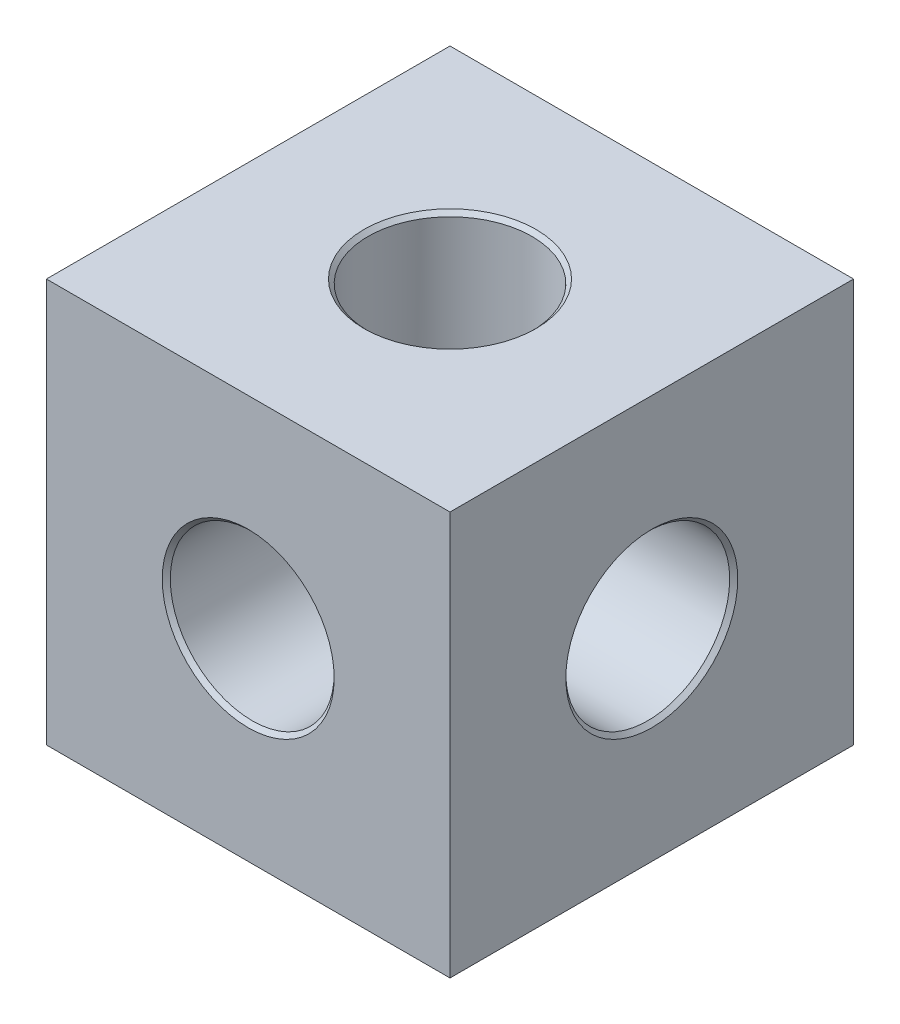
ISO-10303-21;
HEADER;
FILE_DESCRIPTION(('STEP AP214'),'2;1');
FILE_NAME('part.step','',(''),(''),'','','');
FILE_SCHEMA(('AUTOMOTIVE_DESIGN { 1 0 10303 214 1 1 1 1 }'));
ENDSEC;
DATA;
#1=APPLICATION_CONTEXT('core data for automotive mechanical design processes');
#2=APPLICATION_PROTOCOL_DEFINITION('international standard','automotive_design',2000,#1);
#3=PRODUCT_CONTEXT('',#1,'mechanical');
#4=PRODUCT('Part','Part','',(#3));
#5=PRODUCT_RELATED_PRODUCT_CATEGORY('part','',(#4));
#6=PRODUCT_DEFINITION_FORMATION('','',#4);
#7=PRODUCT_DEFINITION_CONTEXT('part definition',#1,'design');
#8=PRODUCT_DEFINITION('design','',#6,#7);
#9=PRODUCT_DEFINITION_SHAPE('','',#8);
#10=(LENGTH_UNIT() NAMED_UNIT(*) SI_UNIT(.MILLI.,.METRE.));
#11=(NAMED_UNIT(*) PLANE_ANGLE_UNIT() SI_UNIT($,.RADIAN.));
#12=(NAMED_UNIT(*) SI_UNIT($,.STERADIAN.) SOLID_ANGLE_UNIT());
#13=UNCERTAINTY_MEASURE_WITH_UNIT(LENGTH_MEASURE(1.E-05),#10,'distance_accuracy_value','');
#14=(GEOMETRIC_REPRESENTATION_CONTEXT(3) GLOBAL_UNCERTAINTY_ASSIGNED_CONTEXT((#13)) GLOBAL_UNIT_ASSIGNED_CONTEXT((#10,
#11,#12)) REPRESENTATION_CONTEXT('',''));
#15=CARTESIAN_POINT('',(0.,0.,0.));
#16=DIRECTION('',(0.,0.,1.));
#17=DIRECTION('',(1.,0.,0.));
#18=AXIS2_PLACEMENT_3D('',#15,#16,#17);
#19=CARTESIAN_POINT('',(-50.2304757814045,37.5309293141299,13.7079780012688));
#20=DIRECTION('',(0.,0.,1.));
#21=DIRECTION('',(1.,0.,0.));
#22=AXIS2_PLACEMENT_3D('',#19,#20,#21);
#23=CYLINDRICAL_SURFACE('',#22,5.1562);
#24=CARTESIAN_POINT('',(-50.2304757814045,37.5309293141299,13.4539780012688));
#25=DIRECTION('',(0.,0.,-1.));
#26=DIRECTION('',(-1.,0.,0.));
#27=AXIS2_PLACEMENT_3D('',#24,#25,#26);
#28=CIRCLE('',#27,5.1562);
#29=CARTESIAN_POINT('',(-55.3866757814045,37.5309293141299,13.4539780012688));
#30=VERTEX_POINT('',#29);
#31=EDGE_CURVE('E24',#30,#30,#28,.F.);
#32=ORIENTED_EDGE('',*,*,#31,.T.);
#33=EDGE_LOOP('',(#32));
#34=FACE_BOUND('',#33,.T.);
#35=CARTESIAN_POINT('',(-50.2304757814045,37.5309293141299,1.00797800126884));
#36=DIRECTION('',(0.,0.707106781186547,0.707106781186547));
#37=DIRECTION('',(0.,-0.707106781186547,0.707106781186547));
#38=AXIS2_PLACEMENT_3D('',#35,#36,#37);
#39=ELLIPSE('',#38,7.29196797030815,5.1562);
#40=CARTESIAN_POINT('',(-46.5844917962504,33.8849453289759,4.65396198642291));
#41=VERTEX_POINT('',#40);
#42=CARTESIAN_POINT('',(-53.8764597665586,33.8849453289759,4.65396198642291));
#43=VERTEX_POINT('',#42);
#44=EDGE_CURVE('E88',#41,#43,#39,.F.);
#45=ORIENTED_EDGE('',*,*,#44,.T.);
#46=CARTESIAN_POINT('',(-50.2304757814045,37.5309293141299,1.00797800126884));
#47=DIRECTION('',(0.707106781186548,0.,0.707106781186547));
#48=DIRECTION('',(-0.707106781186547,0.,0.707106781186547));
#49=AXIS2_PLACEMENT_3D('',#46,#47,#48);
#50=ELLIPSE('',#49,7.29196797030815,5.1562);
#51=CARTESIAN_POINT('',(-53.8764597665586,41.176913299284,4.65396198642291));
#52=VERTEX_POINT('',#51);
#53=EDGE_CURVE('E31',#43,#52,#50,.F.);
#54=ORIENTED_EDGE('',*,*,#53,.T.);
#55=CARTESIAN_POINT('',(-50.2304757814045,37.5309293141299,1.00797800126884));
#56=DIRECTION('',(0.,-0.707106781186547,0.707106781186547));
#57=DIRECTION('',(0.,0.707106781186547,0.707106781186547));
#58=AXIS2_PLACEMENT_3D('',#55,#56,#57);
#59=ELLIPSE('',#58,7.29196797030815,5.1562);
#60=CARTESIAN_POINT('',(-46.5844917962504,41.176913299284,4.65396198642291));
#61=VERTEX_POINT('',#60);
#62=EDGE_CURVE('E102',#52,#61,#59,.F.);
#63=ORIENTED_EDGE('',*,*,#62,.T.);
#64=CARTESIAN_POINT('',(-50.2304757814045,37.5309293141299,1.00797800126884));
#65=DIRECTION('',(-0.707106781186547,0.,0.707106781186547));
#66=DIRECTION('',(0.707106781186548,0.,0.707106781186547));
#67=AXIS2_PLACEMENT_3D('',#64,#65,#66);
#68=ELLIPSE('',#67,7.29196797030815,5.1562);
#69=EDGE_CURVE('E315',#61,#41,#68,.F.);
#70=ORIENTED_EDGE('',*,*,#69,.T.);
#71=EDGE_LOOP('',(#45,#54,#63,#70));
#72=FACE_BOUND('',#71,.T.);
#73=ADVANCED_FACE('F16',(#34,#72),#23,.F.);
#74=CARTESIAN_POINT('',(-62.9304757814045,50.2309293141299,-11.6920219987312));
#75=DIRECTION('',(1.,0.,0.));
#76=DIRECTION('',(0.,0.,-1.));
#77=AXIS2_PLACEMENT_3D('',#74,#75,#76);
#78=PLANE('',#77);
#79=CARTESIAN_POINT('',(-62.9304757814045,37.5309293141299,1.00797800126884));
#80=DIRECTION('',(1.,0.,0.));
#81=DIRECTION('',(0.,0.,-1.));
#82=AXIS2_PLACEMENT_3D('',#79,#80,#81);
#83=CIRCLE('',#82,3.6195);
#84=CARTESIAN_POINT('',(-62.9304757814045,37.5309293141299,-2.61152199873116));
#85=VERTEX_POINT('',#84);
#86=EDGE_CURVE('E118',#85,#85,#83,.T.);
#87=ORIENTED_EDGE('',*,*,#86,.T.);
#88=EDGE_LOOP('',(#87));
#89=FACE_BOUND('',#88,.T.);
#90=DIRECTION('',(0.,0.,1.));
#91=VECTOR('',#90,1.);
#92=CARTESIAN_POINT('',(-62.9304757814045,24.8309293141299,-11.6920219987312));
#93=LINE('',#92,#91);
#94=CARTESIAN_POINT('',(-62.9304757814045,24.8309293141299,-11.6920219987312));
#95=VERTEX_POINT('',#94);
#96=CARTESIAN_POINT('',(-62.9304757814045,24.8309293141299,13.7079780012688));
#97=VERTEX_POINT('',#96);
#98=EDGE_CURVE('E269',#95,#97,#93,.T.);
#99=ORIENTED_EDGE('',*,*,#98,.T.);
#100=DIRECTION('',(0.,-1.,0.));
#101=VECTOR('',#100,1.);
#102=CARTESIAN_POINT('',(-62.9304757814045,50.2309293141299,13.7079780012688));
#103=LINE('',#102,#101);
#104=CARTESIAN_POINT('',(-62.9304757814045,50.2309293141299,13.7079780012688));
#105=VERTEX_POINT('',#104);
#106=EDGE_CURVE('E106',#105,#97,#103,.T.);
#107=ORIENTED_EDGE('',*,*,#106,.F.);
#108=DIRECTION('',(0.,0.,1.));
#109=VECTOR('',#108,1.);
#110=CARTESIAN_POINT('',(-62.9304757814045,50.2309293141299,-11.6920219987312));
#111=LINE('',#110,#109);
#112=CARTESIAN_POINT('',(-62.9304757814045,50.2309293141299,-11.6920219987312));
#113=VERTEX_POINT('',#112);
#114=EDGE_CURVE('E270',#113,#105,#111,.T.);
#115=ORIENTED_EDGE('',*,*,#114,.F.);
#116=DIRECTION('',(0.,-1.,0.));
#117=VECTOR('',#116,1.);
#118=CARTESIAN_POINT('',(-62.9304757814045,50.2309293141299,-11.6920219987312));
#119=LINE('',#118,#117);
#120=EDGE_CURVE('E280',#113,#95,#119,.T.);
#121=ORIENTED_EDGE('',*,*,#120,.T.);
#122=EDGE_LOOP('',(#99,#107,#115,#121));
#123=FACE_BOUND('',#122,.T.);
#124=ADVANCED_FACE('F157',(#89,#123),#78,.F.);
#125=CARTESIAN_POINT('',(-62.9304757814045,50.2309293141299,13.7079780012688));
#126=DIRECTION('',(0.,0.,-1.));
#127=DIRECTION('',(-1.,0.,0.));
#128=AXIS2_PLACEMENT_3D('',#125,#126,#127);
#129=PLANE('',#128);
#130=CARTESIAN_POINT('',(-50.2304757814045,37.5309293141299,13.7079780012688));
#131=DIRECTION('',(0.,0.,-1.));
#132=DIRECTION('',(-1.,0.,0.));
#133=AXIS2_PLACEMENT_3D('',#130,#131,#132);
#134=CIRCLE('',#133,5.41020000000001);
#135=CARTESIAN_POINT('',(-55.6406757814045,37.5309293141299,13.7079780012688));
#136=VERTEX_POINT('',#135);
#137=EDGE_CURVE('E10',#136,#136,#134,.T.);
#138=ORIENTED_EDGE('',*,*,#137,.T.);
#139=EDGE_LOOP('',(#138));
#140=FACE_BOUND('',#139,.T.);
#141=DIRECTION('',(1.,0.,0.));
#142=VECTOR('',#141,1.);
#143=CARTESIAN_POINT('',(-62.9304757814045,24.8309293141299,13.7079780012688));
#144=LINE('',#143,#142);
#145=CARTESIAN_POINT('',(-37.5304757814045,24.8309293141299,13.7079780012688));
#146=VERTEX_POINT('',#145);
#147=EDGE_CURVE('E283',#97,#146,#144,.T.);
#148=ORIENTED_EDGE('',*,*,#147,.T.);
#149=DIRECTION('',(0.,-1.,0.));
#150=VECTOR('',#149,1.);
#151=CARTESIAN_POINT('',(-37.5304757814045,50.2309293141299,13.7079780012688));
#152=LINE('',#151,#150);
#153=CARTESIAN_POINT('',(-37.5304757814045,50.2309293141299,13.7079780012688));
#154=VERTEX_POINT('',#153);
#155=EDGE_CURVE('E293',#154,#146,#152,.T.);
#156=ORIENTED_EDGE('',*,*,#155,.F.);
#157=DIRECTION('',(1.,0.,0.));
#158=VECTOR('',#157,1.);
#159=CARTESIAN_POINT('',(-62.9304757814045,50.2309293141299,13.7079780012688));
#160=LINE('',#159,#158);
#161=EDGE_CURVE('E273',#105,#154,#160,.T.);
#162=ORIENTED_EDGE('',*,*,#161,.F.);
#163=ORIENTED_EDGE('',*,*,#106,.T.);
#164=EDGE_LOOP('',(#148,#156,#162,#163));
#165=FACE_BOUND('',#164,.T.);
#166=ADVANCED_FACE('F162',(#140,#165),#129,.F.);
#167=CARTESIAN_POINT('',(-37.5304757814045,50.2309293141299,-11.6920219987312));
#168=DIRECTION('',(-1.,0.,0.));
#169=DIRECTION('',(0.,0.,1.));
#170=AXIS2_PLACEMENT_3D('',#167,#168,#169);
#171=PLANE('',#170);
#172=CARTESIAN_POINT('',(-37.5304757814045,37.5309293141299,1.00797800126884));
#173=DIRECTION('',(-1.,0.,0.));
#174=DIRECTION('',(0.,0.,1.));
#175=AXIS2_PLACEMENT_3D('',#172,#173,#174);
#176=CIRCLE('',#175,5.41020000000001);
#177=CARTESIAN_POINT('',(-37.5304757814045,37.5309293141299,6.41817800126884));
#178=VERTEX_POINT('',#177);
#179=EDGE_CURVE('E133',#178,#178,#176,.T.);
#180=ORIENTED_EDGE('',*,*,#179,.T.);
#181=EDGE_LOOP('',(#180));
#182=FACE_BOUND('',#181,.T.);
#183=DIRECTION('',(0.,0.,-1.));
#184=VECTOR('',#183,1.);
#185=CARTESIAN_POINT('',(-37.5304757814045,24.8309293141299,-11.6920219987312));
#186=LINE('',#185,#184);
#187=CARTESIAN_POINT('',(-37.5304757814045,24.8309293141299,-11.6920219987312));
#188=VERTEX_POINT('',#187);
#189=EDGE_CURVE('E285',#146,#188,#186,.T.);
#190=ORIENTED_EDGE('',*,*,#189,.T.);
#191=DIRECTION('',(0.,-1.,0.));
#192=VECTOR('',#191,1.);
#193=CARTESIAN_POINT('',(-37.5304757814045,50.2309293141299,-11.6920219987312));
#194=LINE('',#193,#192);
#195=CARTESIAN_POINT('',(-37.5304757814045,50.2309293141299,-11.6920219987312));
#196=VERTEX_POINT('',#195);
#197=EDGE_CURVE('E290',#196,#188,#194,.T.);
#198=ORIENTED_EDGE('',*,*,#197,.F.);
#199=DIRECTION('',(0.,0.,-1.));
#200=VECTOR('',#199,1.);
#201=CARTESIAN_POINT('',(-37.5304757814045,50.2309293141299,-11.6920219987312));
#202=LINE('',#201,#200);
#203=EDGE_CURVE('E276',#154,#196,#202,.T.);
#204=ORIENTED_EDGE('',*,*,#203,.F.);
#205=ORIENTED_EDGE('',*,*,#155,.T.);
#206=EDGE_LOOP('',(#190,#198,#204,#205));
#207=FACE_BOUND('',#206,.T.);
#208=ADVANCED_FACE('F197',(#182,#207),#171,.F.);
#209=CARTESIAN_POINT('',(-62.9304757814045,50.2309293141299,-11.6920219987312));
#210=DIRECTION('',(0.,0.,1.));
#211=DIRECTION('',(1.,0.,0.));
#212=AXIS2_PLACEMENT_3D('',#209,#210,#211);
#213=PLANE('',#212);
#214=CARTESIAN_POINT('',(-50.2304757814045,37.5309293141299,-11.6920219987312));
#215=DIRECTION('',(0.,0.,1.));
#216=DIRECTION('',(1.,0.,0.));
#217=AXIS2_PLACEMENT_3D('',#214,#215,#216);
#218=CIRCLE('',#217,3.61949999999999);
#219=CARTESIAN_POINT('',(-46.6109757814045,37.5309293141299,-11.6920219987312));
#220=VERTEX_POINT('',#219);
#221=EDGE_CURVE('E136',#220,#220,#218,.T.);
#222=ORIENTED_EDGE('',*,*,#221,.T.);
#223=EDGE_LOOP('',(#222));
#224=FACE_BOUND('',#223,.T.);
#225=DIRECTION('',(-1.,0.,0.));
#226=VECTOR('',#225,1.);
#227=CARTESIAN_POINT('',(-62.9304757814045,24.8309293141299,-11.6920219987312));
#228=LINE('',#227,#226);
#229=EDGE_CURVE('E274',#188,#95,#228,.T.);
#230=ORIENTED_EDGE('',*,*,#229,.T.);
#231=ORIENTED_EDGE('',*,*,#120,.F.);
#232=DIRECTION('',(-1.,0.,0.));
#233=VECTOR('',#232,1.);
#234=CARTESIAN_POINT('',(-62.9304757814045,50.2309293141299,-11.6920219987312));
#235=LINE('',#234,#233);
#236=EDGE_CURVE('E278',#196,#113,#235,.T.);
#237=ORIENTED_EDGE('',*,*,#236,.F.);
#238=ORIENTED_EDGE('',*,*,#197,.T.);
#239=EDGE_LOOP('',(#230,#231,#237,#238));
#240=FACE_BOUND('',#239,.T.);
#241=ADVANCED_FACE('F190',(#224,#240),#213,.F.);
#242=CARTESIAN_POINT('',(-62.9304757814045,50.2309293141299,13.7079780012688));
#243=DIRECTION('',(0.,1.,0.));
#244=DIRECTION('',(0.,0.,1.));
#245=AXIS2_PLACEMENT_3D('',#242,#243,#244);
#246=PLANE('',#245);
#247=CARTESIAN_POINT('',(-50.2304757814045,50.2309293141299,1.00797800126884));
#248=DIRECTION('',(0.,1.,0.));
#249=DIRECTION('',(0.,0.,1.));
#250=AXIS2_PLACEMENT_3D('',#247,#248,#249);
#251=CIRCLE('',#250,5.4102);
#252=CARTESIAN_POINT('',(-50.2304757814045,50.2309293141299,6.41817800126884));
#253=VERTEX_POINT('',#252);
#254=EDGE_CURVE('E127',#253,#253,#251,.F.);
#255=ORIENTED_EDGE('',*,*,#254,.T.);
#256=EDGE_LOOP('',(#255));
#257=FACE_BOUND('',#256,.T.);
#258=ORIENTED_EDGE('',*,*,#114,.T.);
#259=ORIENTED_EDGE('',*,*,#161,.T.);
#260=ORIENTED_EDGE('',*,*,#203,.T.);
#261=ORIENTED_EDGE('',*,*,#236,.T.);
#262=EDGE_LOOP('',(#258,#259,#260,#261));
#263=FACE_BOUND('',#262,.T.);
#264=ADVANCED_FACE('F187',(#257,#263),#246,.T.);
#265=CARTESIAN_POINT('',(-62.9304757814045,24.8309293141299,13.7079780012688));
#266=DIRECTION('',(0.,1.,0.));
#267=DIRECTION('',(0.,0.,1.));
#268=AXIS2_PLACEMENT_3D('',#265,#266,#267);
#269=PLANE('',#268);
#270=CARTESIAN_POINT('',(-50.2304757814045,24.8309293141299,1.00797800126884));
#271=DIRECTION('',(0.,1.,0.));
#272=DIRECTION('',(0.,0.,1.));
#273=AXIS2_PLACEMENT_3D('',#270,#271,#272);
#274=CIRCLE('',#273,3.61949999999999);
#275=CARTESIAN_POINT('',(-50.2304757814045,24.8309293141299,4.62747800126883));
#276=VERTEX_POINT('',#275);
#277=EDGE_CURVE('E112',#276,#276,#274,.T.);
#278=ORIENTED_EDGE('',*,*,#277,.T.);
#279=EDGE_LOOP('',(#278));
#280=FACE_BOUND('',#279,.T.);
#281=ORIENTED_EDGE('',*,*,#98,.F.);
#282=ORIENTED_EDGE('',*,*,#229,.F.);
#283=ORIENTED_EDGE('',*,*,#189,.F.);
#284=ORIENTED_EDGE('',*,*,#147,.F.);
#285=EDGE_LOOP('',(#281,#282,#283,#284));
#286=FACE_BOUND('',#285,.T.);
#287=ADVANCED_FACE('F181',(#280,#286),#269,.F.);
#288=CARTESIAN_POINT('',(-50.2304757814045,37.5309293141299,13.7079780012688));
#289=DIRECTION('',(0.,0.,1.));
#290=DIRECTION('',(1.,0.,0.));
#291=AXIS2_PLACEMENT_3D('',#288,#289,#290);
#292=CYLINDRICAL_SURFACE('',#291,3.36549999999999);
#293=CARTESIAN_POINT('',(-50.2304757814045,37.5309293141299,-11.4380219987312));
#294=DIRECTION('',(0.,0.,1.));
#295=DIRECTION('',(1.,0.,0.));
#296=AXIS2_PLACEMENT_3D('',#293,#294,#295);
#297=CIRCLE('',#296,3.36549999999999);
#298=CARTESIAN_POINT('',(-46.8649757814045,37.5309293141299,-11.4380219987312));
#299=VERTEX_POINT('',#298);
#300=EDGE_CURVE('E139',#299,#299,#297,.F.);
#301=ORIENTED_EDGE('',*,*,#300,.T.);
#302=EDGE_LOOP('',(#301));
#303=FACE_BOUND('',#302,.T.);
#304=CARTESIAN_POINT('',(-50.2304757814045,37.5309293141299,-8.89802199873116));
#305=DIRECTION('',(0.,0.,1.));
#306=DIRECTION('',(1.,0.,0.));
#307=AXIS2_PLACEMENT_3D('',#304,#305,#306);
#308=CIRCLE('',#307,3.36549999999999);
#309=CARTESIAN_POINT('',(-46.8649757814045,37.5309293141299,-8.89802199873116));
#310=VERTEX_POINT('',#309);
#311=EDGE_CURVE('E260',#310,#310,#308,.T.);
#312=ORIENTED_EDGE('',*,*,#311,.T.);
#313=EDGE_LOOP('',(#312));
#314=FACE_BOUND('',#313,.T.);
#315=ADVANCED_FACE('F176',(#303,#314),#292,.F.);
#316=CARTESIAN_POINT('',(-46.8649757814045,37.5309293141299,-8.89802199873116));
#317=DIRECTION('',(0.,0.,-1.));
#318=DIRECTION('',(-1.,0.,0.));
#319=AXIS2_PLACEMENT_3D('',#316,#317,#318);
#320=PLANE('',#319);
#321=ORIENTED_EDGE('',*,*,#311,.F.);
#322=EDGE_LOOP('',(#321));
#323=FACE_BOUND('',#322,.T.);
#324=CARTESIAN_POINT('',(-50.2304757814045,37.5309293141299,-8.89802199873116));
#325=DIRECTION('',(0.,0.,1.));
#326=DIRECTION('',(1.,0.,0.));
#327=AXIS2_PLACEMENT_3D('',#324,#325,#326);
#328=CIRCLE('',#327,5.1562);
#329=CARTESIAN_POINT('',(-45.0742757814045,37.5309293141299,-8.89802199873116));
#330=VERTEX_POINT('',#329);
#331=EDGE_CURVE('E256',#330,#330,#328,.T.);
#332=ORIENTED_EDGE('',*,*,#331,.T.);
#333=EDGE_LOOP('',(#332));
#334=FACE_BOUND('',#333,.T.);
#335=ADVANCED_FACE('F169',(#323,#334),#320,.F.);
#336=CARTESIAN_POINT('',(-50.2304757814045,37.5309293141299,1.00797800126884));
#337=DIRECTION('',(0.,-0.707106781186547,0.707106781186547));
#338=DIRECTION('',(0.,0.707106781186547,0.707106781186547));
#339=AXIS2_PLACEMENT_3D('',#336,#337,#338);
#340=ELLIPSE('',#339,7.29196797030815,5.1562);
#341=CARTESIAN_POINT('',(-53.8764597665586,33.8849453289759,-2.63800598388523));
#342=VERTEX_POINT('',#341);
#343=CARTESIAN_POINT('',(-46.5844917962504,33.8849453289759,-2.63800598388524));
#344=VERTEX_POINT('',#343);
#345=EDGE_CURVE('E95',#342,#344,#340,.T.);
#346=ORIENTED_EDGE('',*,*,#345,.T.);
#347=CARTESIAN_POINT('',(-50.2304757814045,37.5309293141299,1.00797800126884));
#348=DIRECTION('',(0.707106781186548,0.,0.707106781186547));
#349=DIRECTION('',(-0.707106781186547,0.,0.707106781186547));
#350=AXIS2_PLACEMENT_3D('',#347,#348,#349);
#351=ELLIPSE('',#350,7.29196797030815,5.1562);
#352=CARTESIAN_POINT('',(-46.5844917962504,41.176913299284,-2.63800598388524));
#353=VERTEX_POINT('',#352);
#354=EDGE_CURVE('E39',#344,#353,#351,.T.);
#355=ORIENTED_EDGE('',*,*,#354,.T.);
#356=CARTESIAN_POINT('',(-50.2304757814045,37.5309293141299,1.00797800126884));
#357=DIRECTION('',(0.,0.707106781186547,0.707106781186547));
#358=DIRECTION('',(0.,-0.707106781186547,0.707106781186547));
#359=AXIS2_PLACEMENT_3D('',#356,#357,#358);
#360=ELLIPSE('',#359,7.29196797030815,5.1562);
#361=CARTESIAN_POINT('',(-53.8764597665586,41.176913299284,-2.63800598388524));
#362=VERTEX_POINT('',#361);
#363=EDGE_CURVE('E97',#353,#362,#360,.T.);
#364=ORIENTED_EDGE('',*,*,#363,.T.);
#365=CARTESIAN_POINT('',(-50.2304757814045,37.5309293141299,1.00797800126884));
#366=DIRECTION('',(-0.707106781186547,0.,0.707106781186547));
#367=DIRECTION('',(0.707106781186548,0.,0.707106781186547));
#368=AXIS2_PLACEMENT_3D('',#365,#366,#367);
#369=ELLIPSE('',#368,7.29196797030815,5.1562);
#370=EDGE_CURVE('E81',#362,#342,#369,.T.);
#371=ORIENTED_EDGE('',*,*,#370,.T.);
#372=EDGE_LOOP('',(#346,#355,#364,#371));
#373=FACE_BOUND('',#372,.T.);
#374=ORIENTED_EDGE('',*,*,#331,.F.);
#375=EDGE_LOOP('',(#374));
#376=FACE_BOUND('',#375,.T.);
#377=ADVANCED_FACE('F93',(#373,#376),#23,.F.);
#378=CARTESIAN_POINT('',(-50.2304757814045,50.2309293141299,1.00797800126884));
#379=DIRECTION('',(0.,1.,0.));
#380=DIRECTION('',(0.,0.,1.));
#381=AXIS2_PLACEMENT_3D('',#378,#379,#380);
#382=CYLINDRICAL_SURFACE('',#381,5.15619999999999);
#383=CARTESIAN_POINT('',(-50.2304757814045,49.9769293141299,1.00797800126884));
#384=DIRECTION('',(0.,1.,0.));
#385=DIRECTION('',(0.,0.,1.));
#386=AXIS2_PLACEMENT_3D('',#383,#384,#385);
#387=CIRCLE('',#386,5.15619999999999);
#388=CARTESIAN_POINT('',(-50.2304757814045,49.9769293141299,6.16417800126883));
#389=VERTEX_POINT('',#388);
#390=EDGE_CURVE('E124',#389,#389,#387,.T.);
#391=ORIENTED_EDGE('',*,*,#390,.T.);
#392=EDGE_LOOP('',(#391));
#393=FACE_BOUND('',#392,.T.);
#394=ORIENTED_EDGE('',*,*,#62,.F.);
#395=CARTESIAN_POINT('',(-50.2304757814045,37.5309293141299,1.00797800126884));
#396=DIRECTION('',(0.707106781186547,0.707106781186547,0.));
#397=DIRECTION('',(-0.707106781186547,0.707106781186547,0.));
#398=AXIS2_PLACEMENT_3D('',#395,#396,#397);
#399=ELLIPSE('',#398,7.29196797030814,5.15619999999999);
#400=EDGE_CURVE('E98',#52,#362,#399,.F.);
#401=ORIENTED_EDGE('',*,*,#400,.T.);
#402=ORIENTED_EDGE('',*,*,#363,.F.);
#403=CARTESIAN_POINT('',(-50.2304757814045,37.5309293141299,1.00797800126884));
#404=DIRECTION('',(-0.707106781186547,0.707106781186547,0.));
#405=DIRECTION('',(0.707106781186547,0.707106781186547,0.));
#406=AXIS2_PLACEMENT_3D('',#403,#404,#405);
#407=ELLIPSE('',#406,7.29196797030814,5.15619999999999);
#408=EDGE_CURVE('E263',#353,#61,#407,.F.);
#409=ORIENTED_EDGE('',*,*,#408,.T.);
#410=EDGE_LOOP('',(#394,#401,#402,#409));
#411=FACE_BOUND('',#410,.T.);
#412=ADVANCED_FACE('F168',(#393,#411),#382,.F.);
#413=CARTESIAN_POINT('',(-50.2304757814045,27.6249293141299,1.00797800126884));
#414=DIRECTION('',(0.,1.,0.));
#415=DIRECTION('',(0.,0.,1.));
#416=AXIS2_PLACEMENT_3D('',#413,#414,#415);
#417=CIRCLE('',#416,5.15619999999999);
#418=CARTESIAN_POINT('',(-50.2304757814045,27.6249293141299,6.16417800126883));
#419=VERTEX_POINT('',#418);
#420=EDGE_CURVE('E257',#419,#419,#417,.T.);
#421=ORIENTED_EDGE('',*,*,#420,.F.);
#422=EDGE_LOOP('',(#421));
#423=FACE_BOUND('',#422,.T.);
#424=ORIENTED_EDGE('',*,*,#44,.F.);
#425=CARTESIAN_POINT('',(-50.2304757814045,37.5309293141299,1.00797800126884));
#426=DIRECTION('',(0.707106781186547,0.707106781186547,0.));
#427=DIRECTION('',(-0.707106781186547,0.707106781186547,0.));
#428=AXIS2_PLACEMENT_3D('',#425,#426,#427);
#429=ELLIPSE('',#428,7.29196797030814,5.15619999999999);
#430=EDGE_CURVE('E87',#41,#344,#429,.T.);
#431=ORIENTED_EDGE('',*,*,#430,.T.);
#432=ORIENTED_EDGE('',*,*,#345,.F.);
#433=CARTESIAN_POINT('',(-50.2304757814045,37.5309293141299,1.00797800126884));
#434=DIRECTION('',(-0.707106781186547,0.707106781186547,0.));
#435=DIRECTION('',(0.707106781186547,0.707106781186547,0.));
#436=AXIS2_PLACEMENT_3D('',#433,#434,#435);
#437=ELLIPSE('',#436,7.29196797030814,5.15619999999999);
#438=EDGE_CURVE('E78',#342,#43,#437,.T.);
#439=ORIENTED_EDGE('',*,*,#438,.T.);
#440=EDGE_LOOP('',(#424,#431,#432,#439));
#441=FACE_BOUND('',#440,.T.);
#442=ADVANCED_FACE('F101',(#423,#441),#382,.F.);
#443=CARTESIAN_POINT('',(-50.2304757814045,50.2309293141299,1.00797800126884));
#444=DIRECTION('',(0.,1.,0.));
#445=DIRECTION('',(0.,0.,1.));
#446=AXIS2_PLACEMENT_3D('',#443,#444,#445);
#447=CYLINDRICAL_SURFACE('',#446,3.3655);
#448=CARTESIAN_POINT('',(-50.2304757814045,25.0849293141299,1.00797800126884));
#449=DIRECTION('',(0.,1.,0.));
#450=DIRECTION('',(0.,0.,1.));
#451=AXIS2_PLACEMENT_3D('',#448,#449,#450);
#452=CIRCLE('',#451,3.3655);
#453=CARTESIAN_POINT('',(-50.2304757814045,25.0849293141299,4.37347800126884));
#454=VERTEX_POINT('',#453);
#455=EDGE_CURVE('E115',#454,#454,#452,.F.);
#456=ORIENTED_EDGE('',*,*,#455,.T.);
#457=EDGE_LOOP('',(#456));
#458=FACE_BOUND('',#457,.T.);
#459=CARTESIAN_POINT('',(-50.2304757814045,27.6249293141299,1.00797800126884));
#460=DIRECTION('',(0.,1.,0.));
#461=DIRECTION('',(0.,0.,1.));
#462=AXIS2_PLACEMENT_3D('',#459,#460,#461);
#463=CIRCLE('',#462,3.36550000000001);
#464=CARTESIAN_POINT('',(-50.2304757814045,27.6249293141299,4.37347800126884));
#465=VERTEX_POINT('',#464);
#466=EDGE_CURVE('E255',#465,#465,#463,.T.);
#467=ORIENTED_EDGE('',*,*,#466,.T.);
#468=EDGE_LOOP('',(#467));
#469=FACE_BOUND('',#468,.T.);
#470=ADVANCED_FACE('F243',(#458,#469),#447,.F.);
#471=CARTESIAN_POINT('',(-46.8649757814045,27.6249293141299,1.00797800126884));
#472=DIRECTION('',(0.,-1.,0.));
#473=DIRECTION('',(0.,0.,-1.));
#474=AXIS2_PLACEMENT_3D('',#471,#472,#473);
#475=PLANE('',#474);
#476=ORIENTED_EDGE('',*,*,#466,.F.);
#477=EDGE_LOOP('',(#476));
#478=FACE_BOUND('',#477,.T.);
#479=ORIENTED_EDGE('',*,*,#420,.T.);
#480=EDGE_LOOP('',(#479));
#481=FACE_BOUND('',#480,.T.);
#482=ADVANCED_FACE('F237',(#478,#481),#475,.F.);
#483=CARTESIAN_POINT('',(-60.1364757814045,40.8964293141299,1.00797800126884));
#484=DIRECTION('',(-1.,0.,0.));
#485=DIRECTION('',(0.,0.,1.));
#486=AXIS2_PLACEMENT_3D('',#483,#484,#485);
#487=PLANE('',#486);
#488=CARTESIAN_POINT('',(-60.1364757814045,37.5309293141299,1.00797800126884));
#489=DIRECTION('',(1.,0.,0.));
#490=DIRECTION('',(0.,0.,-1.));
#491=AXIS2_PLACEMENT_3D('',#488,#489,#490);
#492=CIRCLE('',#491,3.36550000000001);
#493=CARTESIAN_POINT('',(-60.1364757814045,37.5309293141299,-2.35752199873117));
#494=VERTEX_POINT('',#493);
#495=EDGE_CURVE('E99',#494,#494,#492,.T.);
#496=ORIENTED_EDGE('',*,*,#495,.F.);
#497=EDGE_LOOP('',(#496));
#498=FACE_BOUND('',#497,.T.);
#499=CARTESIAN_POINT('',(-60.1364757814045,37.5309293141299,1.00797800126884));
#500=DIRECTION('',(1.,0.,0.));
#501=DIRECTION('',(0.,0.,-1.));
#502=AXIS2_PLACEMENT_3D('',#499,#500,#501);
#503=CIRCLE('',#502,5.15619999999999);
#504=CARTESIAN_POINT('',(-60.1364757814045,37.5309293141299,-4.14822199873116));
#505=VERTEX_POINT('',#504);
#506=EDGE_CURVE('E323',#505,#505,#503,.T.);
#507=ORIENTED_EDGE('',*,*,#506,.T.);
#508=EDGE_LOOP('',(#507));
#509=FACE_BOUND('',#508,.T.);
#510=ADVANCED_FACE('F234',(#498,#509),#487,.F.);
#511=CARTESIAN_POINT('',(-37.5304757814045,37.5309293141299,1.00797800126884));
#512=DIRECTION('',(1.,0.,0.));
#513=DIRECTION('',(0.,0.,-1.));
#514=AXIS2_PLACEMENT_3D('',#511,#512,#513);
#515=CYLINDRICAL_SURFACE('',#514,3.3655);
#516=CARTESIAN_POINT('',(-62.6764757814045,37.5309293141299,1.00797800126884));
#517=DIRECTION('',(1.,0.,0.));
#518=DIRECTION('',(0.,0.,-1.));
#519=AXIS2_PLACEMENT_3D('',#516,#517,#518);
#520=CIRCLE('',#519,3.3655);
#521=CARTESIAN_POINT('',(-62.6764757814045,37.5309293141299,-2.35752199873116));
#522=VERTEX_POINT('',#521);
#523=EDGE_CURVE('E121',#522,#522,#520,.F.);
#524=ORIENTED_EDGE('',*,*,#523,.T.);
#525=EDGE_LOOP('',(#524));
#526=FACE_BOUND('',#525,.T.);
#527=ORIENTED_EDGE('',*,*,#495,.T.);
#528=EDGE_LOOP('',(#527));
#529=FACE_BOUND('',#528,.T.);
#530=ADVANCED_FACE('F231',(#526,#529),#515,.F.);
#531=CARTESIAN_POINT('',(-37.5304757814045,37.5309293141299,1.00797800126884));
#532=DIRECTION('',(1.,0.,0.));
#533=DIRECTION('',(0.,0.,-1.));
#534=AXIS2_PLACEMENT_3D('',#531,#532,#533);
#535=CYLINDRICAL_SURFACE('',#534,5.15619999999999);
#536=ORIENTED_EDGE('',*,*,#506,.F.);
#537=EDGE_LOOP('',(#536));
#538=FACE_BOUND('',#537,.T.);
#539=ORIENTED_EDGE('',*,*,#438,.F.);
#540=ORIENTED_EDGE('',*,*,#370,.F.);
#541=ORIENTED_EDGE('',*,*,#400,.F.);
#542=ORIENTED_EDGE('',*,*,#53,.F.);
#543=EDGE_LOOP('',(#539,#540,#541,#542));
#544=FACE_BOUND('',#543,.T.);
#545=ADVANCED_FACE('F80',(#538,#544),#535,.F.);
#546=CARTESIAN_POINT('',(-37.7844757814045,37.5309293141299,1.00797800126884));
#547=DIRECTION('',(-1.,0.,0.));
#548=DIRECTION('',(0.,0.,1.));
#549=AXIS2_PLACEMENT_3D('',#546,#547,#548);
#550=CIRCLE('',#549,5.15619999999999);
#551=CARTESIAN_POINT('',(-37.7844757814045,37.5309293141299,6.16417800126883));
#552=VERTEX_POINT('',#551);
#553=EDGE_CURVE('E130',#552,#552,#550,.F.);
#554=ORIENTED_EDGE('',*,*,#553,.T.);
#555=EDGE_LOOP('',(#554));
#556=FACE_BOUND('',#555,.T.);
#557=ORIENTED_EDGE('',*,*,#354,.F.);
#558=ORIENTED_EDGE('',*,*,#430,.F.);
#559=ORIENTED_EDGE('',*,*,#69,.F.);
#560=ORIENTED_EDGE('',*,*,#408,.F.);
#561=EDGE_LOOP('',(#557,#558,#559,#560));
#562=FACE_BOUND('',#561,.T.);
#563=ADVANCED_FACE('F209',(#556,#562),#535,.F.);
#564=CARTESIAN_POINT('',(-50.2304757814045,24.8309293141299,1.00797800126884));
#565=DIRECTION('',(0.,-1.,0.));
#566=DIRECTION('',(0.,0.,-1.));
#567=AXIS2_PLACEMENT_3D('',#564,#565,#566);
#568=CONICAL_SURFACE('',#567,3.61949999999999,0.785398163397443);
#569=ORIENTED_EDGE('',*,*,#455,.F.);
#570=EDGE_LOOP('',(#569));
#571=FACE_BOUND('',#570,.T.);
#572=ORIENTED_EDGE('',*,*,#277,.F.);
#573=EDGE_LOOP('',(#572));
#574=FACE_BOUND('',#573,.T.);
#575=ADVANCED_FACE('F205',(#571,#574),#568,.F.);
#576=CARTESIAN_POINT('',(-62.9304757814045,37.5309293141299,1.00797800126884));
#577=DIRECTION('',(-1.,0.,0.));
#578=DIRECTION('',(0.,0.,1.));
#579=AXIS2_PLACEMENT_3D('',#576,#577,#578);
#580=CONICAL_SURFACE('',#579,3.6195,0.785398163397457);
#581=ORIENTED_EDGE('',*,*,#523,.F.);
#582=EDGE_LOOP('',(#581));
#583=FACE_BOUND('',#582,.T.);
#584=ORIENTED_EDGE('',*,*,#86,.F.);
#585=EDGE_LOOP('',(#584));
#586=FACE_BOUND('',#585,.T.);
#587=ADVANCED_FACE('F208',(#583,#586),#580,.F.);
#588=CARTESIAN_POINT('',(-50.2304757814045,49.9769293141299,1.00797800126884));
#589=DIRECTION('',(0.,1.,0.));
#590=DIRECTION('',(0.,0.,1.));
#591=AXIS2_PLACEMENT_3D('',#588,#589,#590);
#592=CONICAL_SURFACE('',#591,5.15619999999999,0.785398163397458);
#593=ORIENTED_EDGE('',*,*,#254,.F.);
#594=EDGE_LOOP('',(#593));
#595=FACE_BOUND('',#594,.T.);
#596=ORIENTED_EDGE('',*,*,#390,.F.);
#597=EDGE_LOOP('',(#596));
#598=FACE_BOUND('',#597,.T.);
#599=ADVANCED_FACE('F213',(#595,#598),#592,.F.);
#600=CARTESIAN_POINT('',(-37.7844757814045,37.5309293141299,1.00797800126884));
#601=DIRECTION('',(1.,0.,0.));
#602=DIRECTION('',(0.,0.,-1.));
#603=AXIS2_PLACEMENT_3D('',#600,#601,#602);
#604=CONICAL_SURFACE('',#603,5.15619999999999,0.785398163397462);
#605=ORIENTED_EDGE('',*,*,#179,.F.);
#606=EDGE_LOOP('',(#605));
#607=FACE_BOUND('',#606,.T.);
#608=ORIENTED_EDGE('',*,*,#553,.F.);
#609=EDGE_LOOP('',(#608));
#610=FACE_BOUND('',#609,.T.);
#611=ADVANCED_FACE('F153',(#607,#610),#604,.F.);
#612=CARTESIAN_POINT('',(-50.2304757814045,37.5309293141299,-11.6920219987312));
#613=DIRECTION('',(0.,0.,-1.));
#614=DIRECTION('',(-1.,0.,0.));
#615=AXIS2_PLACEMENT_3D('',#612,#613,#614);
#616=CONICAL_SURFACE('',#615,3.61949999999999,0.785398163397447);
#617=ORIENTED_EDGE('',*,*,#300,.F.);
#618=EDGE_LOOP('',(#617));
#619=FACE_BOUND('',#618,.T.);
#620=ORIENTED_EDGE('',*,*,#221,.F.);
#621=EDGE_LOOP('',(#620));
#622=FACE_BOUND('',#621,.T.);
#623=ADVANCED_FACE('F147',(#619,#622),#616,.F.);
#624=CARTESIAN_POINT('',(-50.2304757814045,37.5309293141299,13.4539780012688));
#625=DIRECTION('',(0.,0.,1.));
#626=DIRECTION('',(1.,0.,0.));
#627=AXIS2_PLACEMENT_3D('',#624,#625,#626);
#628=CONICAL_SURFACE('',#627,5.1562,0.785398163397452);
#629=ORIENTED_EDGE('',*,*,#137,.F.);
#630=EDGE_LOOP('',(#629));
#631=FACE_BOUND('',#630,.T.);
#632=ORIENTED_EDGE('',*,*,#31,.F.);
#633=EDGE_LOOP('',(#632));
#634=FACE_BOUND('',#633,.T.);
#635=ADVANCED_FACE('F18',(#631,#634),#628,.F.);
#636=CLOSED_SHELL('',(#73,#124,#166,#208,#241,#264,#287,#315,#335,#377,#412,#442,#470,#482,#510,
#530,#545,#563,#575,#587,#599,#611,#623,#635));
#637=MANIFOLD_SOLID_BREP('B1',#636);
#638=ADVANCED_BREP_SHAPE_REPRESENTATION('',(#18,#637),#14);
#639=SHAPE_DEFINITION_REPRESENTATION(#9,#638);
ENDSEC;
END-ISO-10303-21;
